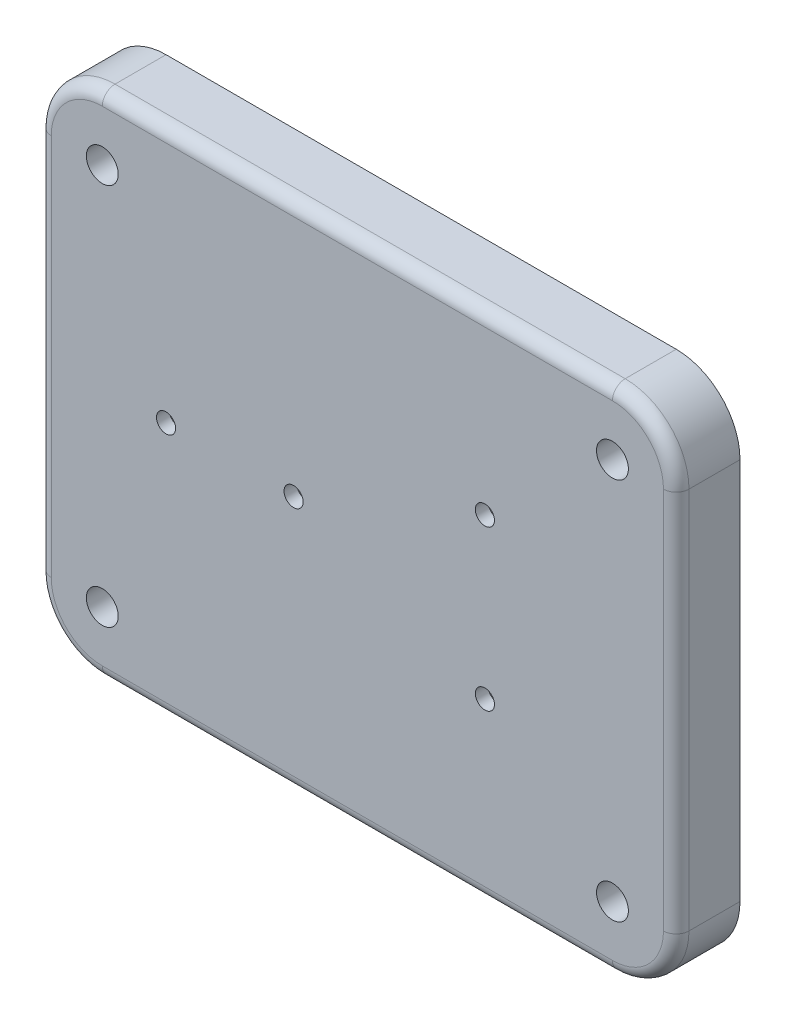
ISO-10303-21;
HEADER;
FILE_DESCRIPTION(('STEP AP214'),'2;1');
FILE_NAME('part.step','',(''),(''),'','','');
FILE_SCHEMA(('AUTOMOTIVE_DESIGN { 1 0 10303 214 1 1 1 1 }'));
ENDSEC;
DATA;
#1=APPLICATION_CONTEXT('core data for automotive mechanical design processes');
#2=APPLICATION_PROTOCOL_DEFINITION('international standard','automotive_design',2000,#1);
#3=PRODUCT_CONTEXT('',#1,'mechanical');
#4=PRODUCT('Part','Part','',(#3));
#5=PRODUCT_RELATED_PRODUCT_CATEGORY('part','',(#4));
#6=PRODUCT_DEFINITION_FORMATION('','',#4);
#7=PRODUCT_DEFINITION_CONTEXT('part definition',#1,'design');
#8=PRODUCT_DEFINITION('design','',#6,#7);
#9=PRODUCT_DEFINITION_SHAPE('','',#8);
#10=(LENGTH_UNIT() NAMED_UNIT(*) SI_UNIT(.MILLI.,.METRE.));
#11=(NAMED_UNIT(*) PLANE_ANGLE_UNIT() SI_UNIT($,.RADIAN.));
#12=(NAMED_UNIT(*) SI_UNIT($,.STERADIAN.) SOLID_ANGLE_UNIT());
#13=UNCERTAINTY_MEASURE_WITH_UNIT(LENGTH_MEASURE(1.E-05),#10,'distance_accuracy_value','');
#14=(GEOMETRIC_REPRESENTATION_CONTEXT(3) GLOBAL_UNCERTAINTY_ASSIGNED_CONTEXT((#13)) GLOBAL_UNIT_ASSIGNED_CONTEXT((#10,
#11,#12)) REPRESENTATION_CONTEXT('',''));
#15=CARTESIAN_POINT('',(0.,0.,0.));
#16=DIRECTION('',(0.,0.,1.));
#17=DIRECTION('',(1.,0.,0.));
#18=AXIS2_PLACEMENT_3D('',#15,#16,#17);
#19=CARTESIAN_POINT('',(0.,0.,0.));
#20=DIRECTION('',(0.,0.,-1.));
#21=DIRECTION('',(-1.,0.,0.));
#22=AXIS2_PLACEMENT_3D('',#19,#20,#21);
#23=PLANE('',#22);
#24=CARTESIAN_POINT('',(-40.,-30.,0.));
#25=DIRECTION('',(0.,0.,-1.));
#26=DIRECTION('',(1.,0.,0.));
#27=AXIS2_PLACEMENT_3D('',#24,#25,#26);
#28=CIRCLE('',#27,2.5);
#29=CARTESIAN_POINT('',(-37.5,-30.,0.));
#30=VERTEX_POINT('',#29);
#31=EDGE_CURVE('E310',#30,#30,#28,.T.);
#32=ORIENTED_EDGE('',*,*,#31,.F.);
#33=EDGE_LOOP('',(#32));
#34=FACE_BOUND('',#33,.T.);
#35=CARTESIAN_POINT('',(-40.,-30.,0.));
#36=DIRECTION('',(0.,0.,-1.));
#37=DIRECTION('',(-1.,0.,0.));
#38=AXIS2_PLACEMENT_3D('',#35,#36,#37);
#39=CIRCLE('',#38,4.5);
#40=CARTESIAN_POINT('',(-44.5,-30.,0.));
#41=VERTEX_POINT('',#40);
#42=EDGE_CURVE('E246',#41,#41,#39,.T.);
#43=ORIENTED_EDGE('',*,*,#42,.T.);
#44=EDGE_LOOP('',(#43));
#45=FACE_BOUND('',#44,.T.);
#46=ADVANCED_FACE('F39',(#34,#45),#23,.T.);
#47=CARTESIAN_POINT('',(40.,30.,0.));
#48=DIRECTION('',(0.,0.,-1.));
#49=DIRECTION('',(-1.,0.,0.));
#50=AXIS2_PLACEMENT_3D('',#47,#48,#49);
#51=CIRCLE('',#50,2.5);
#52=CARTESIAN_POINT('',(37.5,30.,0.));
#53=VERTEX_POINT('',#52);
#54=EDGE_CURVE('E328',#53,#53,#51,.T.);
#55=ORIENTED_EDGE('',*,*,#54,.F.);
#56=EDGE_LOOP('',(#55));
#57=FACE_BOUND('',#56,.T.);
#58=CARTESIAN_POINT('',(40.,30.,0.));
#59=DIRECTION('',(0.,0.,-1.));
#60=DIRECTION('',(-1.,0.,0.));
#61=AXIS2_PLACEMENT_3D('',#58,#59,#60);
#62=CIRCLE('',#61,4.5);
#63=CARTESIAN_POINT('',(35.5,30.,0.));
#64=VERTEX_POINT('',#63);
#65=EDGE_CURVE('E256',#64,#64,#62,.T.);
#66=ORIENTED_EDGE('',*,*,#65,.T.);
#67=EDGE_LOOP('',(#66));
#68=FACE_BOUND('',#67,.T.);
#69=ADVANCED_FACE('F564',(#57,#68),#23,.T.);
#70=CARTESIAN_POINT('',(40.,-30.,0.));
#71=DIRECTION('',(0.,0.,-1.));
#72=DIRECTION('',(-1.,0.,0.));
#73=AXIS2_PLACEMENT_3D('',#70,#71,#72);
#74=CIRCLE('',#73,4.5);
#75=CARTESIAN_POINT('',(35.5,-30.,0.));
#76=VERTEX_POINT('',#75);
#77=EDGE_CURVE('E251',#76,#76,#74,.F.);
#78=ORIENTED_EDGE('',*,*,#77,.F.);
#79=EDGE_LOOP('',(#78));
#80=FACE_BOUND('',#79,.T.);
#81=CARTESIAN_POINT('',(40.,-30.,0.));
#82=DIRECTION('',(0.,0.,1.));
#83=DIRECTION('',(-1.,0.,0.));
#84=AXIS2_PLACEMENT_3D('',#81,#82,#83);
#85=CIRCLE('',#84,2.5);
#86=CARTESIAN_POINT('',(37.5,-30.,0.));
#87=VERTEX_POINT('',#86);
#88=EDGE_CURVE('E320',#87,#87,#85,.T.);
#89=ORIENTED_EDGE('',*,*,#88,.T.);
#90=EDGE_LOOP('',(#89));
#91=FACE_BOUND('',#90,.T.);
#92=ADVANCED_FACE('F570',(#80,#91),#23,.T.);
#93=DIRECTION('',(0.,-1.,0.));
#94=VECTOR('',#93,1.);
#95=CARTESIAN_POINT('',(-50.,40.,0.));
#96=LINE('',#95,#94);
#97=CARTESIAN_POINT('',(-50.,30.,0.));
#98=VERTEX_POINT('',#97);
#99=CARTESIAN_POINT('',(-50.,-30.,0.));
#100=VERTEX_POINT('',#99);
#101=EDGE_CURVE('E340',#98,#100,#96,.T.);
#102=ORIENTED_EDGE('',*,*,#101,.F.);
#103=CARTESIAN_POINT('',(-40.,30.,0.));
#104=DIRECTION('',(0.,0.,-1.));
#105=DIRECTION('',(-1.,0.,0.));
#106=AXIS2_PLACEMENT_3D('',#103,#104,#105);
#107=CIRCLE('',#106,10.);
#108=CARTESIAN_POINT('',(-40.,40.,0.));
#109=VERTEX_POINT('',#108);
#110=EDGE_CURVE('E375',#98,#109,#107,.T.);
#111=ORIENTED_EDGE('',*,*,#110,.T.);
#112=DIRECTION('',(-1.,0.,0.));
#113=VECTOR('',#112,1.);
#114=CARTESIAN_POINT('',(50.,40.,0.));
#115=LINE('',#114,#113);
#116=CARTESIAN_POINT('',(40.,40.,0.));
#117=VERTEX_POINT('',#116);
#118=EDGE_CURVE('E355',#117,#109,#115,.T.);
#119=ORIENTED_EDGE('',*,*,#118,.F.);
#120=CARTESIAN_POINT('',(40.,30.,0.));
#121=DIRECTION('',(0.,0.,-1.));
#122=DIRECTION('',(-1.,0.,0.));
#123=AXIS2_PLACEMENT_3D('',#120,#121,#122);
#124=CIRCLE('',#123,10.);
#125=CARTESIAN_POINT('',(50.,30.,0.));
#126=VERTEX_POINT('',#125);
#127=EDGE_CURVE('E366',#117,#126,#124,.T.);
#128=ORIENTED_EDGE('',*,*,#127,.T.);
#129=DIRECTION('',(0.,1.,0.));
#130=VECTOR('',#129,1.);
#131=CARTESIAN_POINT('',(50.,40.,0.));
#132=LINE('',#131,#130);
#133=CARTESIAN_POINT('',(50.,-30.,0.));
#134=VERTEX_POINT('',#133);
#135=EDGE_CURVE('E351',#134,#126,#132,.T.);
#136=ORIENTED_EDGE('',*,*,#135,.F.);
#137=CARTESIAN_POINT('',(40.,-30.,0.));
#138=DIRECTION('',(0.,0.,-1.));
#139=DIRECTION('',(-1.,0.,0.));
#140=AXIS2_PLACEMENT_3D('',#137,#138,#139);
#141=CIRCLE('',#140,10.);
#142=CARTESIAN_POINT('',(40.,-40.,0.));
#143=VERTEX_POINT('',#142);
#144=EDGE_CURVE('E369',#134,#143,#141,.T.);
#145=ORIENTED_EDGE('',*,*,#144,.T.);
#146=DIRECTION('',(1.,0.,0.));
#147=VECTOR('',#146,1.);
#148=CARTESIAN_POINT('',(50.,-40.,0.));
#149=LINE('',#148,#147);
#150=CARTESIAN_POINT('',(-40.,-40.,0.));
#151=VERTEX_POINT('',#150);
#152=EDGE_CURVE('E347',#151,#143,#149,.T.);
#153=ORIENTED_EDGE('',*,*,#152,.F.);
#154=CARTESIAN_POINT('',(-40.,-30.,0.));
#155=DIRECTION('',(0.,0.,-1.));
#156=DIRECTION('',(-1.,0.,0.));
#157=AXIS2_PLACEMENT_3D('',#154,#155,#156);
#158=CIRCLE('',#157,10.);
#159=EDGE_CURVE('E372',#151,#100,#158,.T.);
#160=ORIENTED_EDGE('',*,*,#159,.T.);
#161=EDGE_LOOP('',(#102,#111,#119,#128,#136,#145,#153,#160));
#162=FACE_BOUND('',#161,.T.);
#163=CARTESIAN_POINT('',(-40.,30.,0.));
#164=DIRECTION('',(0.,0.,-1.));
#165=DIRECTION('',(-1.,0.,0.));
#166=AXIS2_PLACEMENT_3D('',#163,#164,#165);
#167=CIRCLE('',#166,8.);
#168=CARTESIAN_POINT('',(-48.,30.,0.));
#169=VERTEX_POINT('',#168);
#170=CARTESIAN_POINT('',(-40.,38.,0.));
#171=VERTEX_POINT('',#170);
#172=EDGE_CURVE('E277',#169,#171,#167,.T.);
#173=ORIENTED_EDGE('',*,*,#172,.F.);
#174=DIRECTION('',(0.,-1.,0.));
#175=VECTOR('',#174,1.);
#176=CARTESIAN_POINT('',(-48.,0.,0.));
#177=LINE('',#176,#175);
#178=CARTESIAN_POINT('',(-48.,-30.,0.));
#179=VERTEX_POINT('',#178);
#180=EDGE_CURVE('E281',#169,#179,#177,.T.);
#181=ORIENTED_EDGE('',*,*,#180,.T.);
#182=CARTESIAN_POINT('',(-40.,-30.,0.));
#183=DIRECTION('',(0.,0.,-1.));
#184=DIRECTION('',(-1.,0.,0.));
#185=AXIS2_PLACEMENT_3D('',#182,#183,#184);
#186=CIRCLE('',#185,8.);
#187=CARTESIAN_POINT('',(-40.,-38.,0.));
#188=VERTEX_POINT('',#187);
#189=EDGE_CURVE('E210',#188,#179,#186,.T.);
#190=ORIENTED_EDGE('',*,*,#189,.F.);
#191=DIRECTION('',(1.,0.,0.));
#192=VECTOR('',#191,1.);
#193=CARTESIAN_POINT('',(0.,-38.,0.));
#194=LINE('',#193,#192);
#195=CARTESIAN_POINT('',(40.,-38.,0.));
#196=VERTEX_POINT('',#195);
#197=EDGE_CURVE('E57',#188,#196,#194,.T.);
#198=ORIENTED_EDGE('',*,*,#197,.T.);
#199=CARTESIAN_POINT('',(40.,-30.,0.));
#200=DIRECTION('',(0.,0.,-1.));
#201=DIRECTION('',(-1.,0.,0.));
#202=AXIS2_PLACEMENT_3D('',#199,#200,#201);
#203=CIRCLE('',#202,8.);
#204=CARTESIAN_POINT('',(48.,-30.,0.));
#205=VERTEX_POINT('',#204);
#206=EDGE_CURVE('E288',#205,#196,#203,.T.);
#207=ORIENTED_EDGE('',*,*,#206,.F.);
#208=DIRECTION('',(0.,1.,0.));
#209=VECTOR('',#208,1.);
#210=CARTESIAN_POINT('',(48.,0.,0.));
#211=LINE('',#210,#209);
#212=CARTESIAN_POINT('',(48.,30.,0.));
#213=VERTEX_POINT('',#212);
#214=EDGE_CURVE('E219',#205,#213,#211,.T.);
#215=ORIENTED_EDGE('',*,*,#214,.T.);
#216=CARTESIAN_POINT('',(40.,30.,0.));
#217=DIRECTION('',(0.,0.,-1.));
#218=DIRECTION('',(-1.,0.,0.));
#219=AXIS2_PLACEMENT_3D('',#216,#217,#218);
#220=CIRCLE('',#219,8.);
#221=CARTESIAN_POINT('',(40.,38.,0.));
#222=VERTEX_POINT('',#221);
#223=EDGE_CURVE('E216',#222,#213,#220,.T.);
#224=ORIENTED_EDGE('',*,*,#223,.F.);
#225=DIRECTION('',(-1.,0.,0.));
#226=VECTOR('',#225,1.);
#227=CARTESIAN_POINT('',(0.,38.,0.));
#228=LINE('',#227,#226);
#229=EDGE_CURVE('E212',#222,#171,#228,.T.);
#230=ORIENTED_EDGE('',*,*,#229,.T.);
#231=EDGE_LOOP('',(#173,#181,#190,#198,#207,#215,#224,#230));
#232=FACE_BOUND('',#231,.T.);
#233=ADVANCED_FACE('F578',(#162,#232),#23,.T.);
#234=CARTESIAN_POINT('',(-50.,40.,10.));
#235=DIRECTION('',(1.,0.,0.));
#236=DIRECTION('',(0.,1.,0.));
#237=AXIS2_PLACEMENT_3D('',#234,#235,#236);
#238=PLANE('',#237);
#239=DIRECTION('',(0.,0.,-1.));
#240=VECTOR('',#239,1.);
#241=CARTESIAN_POINT('',(-50.,-30.,10.));
#242=LINE('',#241,#240);
#243=CARTESIAN_POINT('',(-50.,-30.,8.));
#244=VERTEX_POINT('',#243);
#245=EDGE_CURVE('E359',#100,#244,#242,.F.);
#246=ORIENTED_EDGE('',*,*,#245,.T.);
#247=DIRECTION('',(0.,-1.,0.));
#248=VECTOR('',#247,1.);
#249=CARTESIAN_POINT('',(-50.,40.,8.));
#250=LINE('',#249,#248);
#251=CARTESIAN_POINT('',(-50.,30.,8.));
#252=VERTEX_POINT('',#251);
#253=EDGE_CURVE('E439',#244,#252,#250,.F.);
#254=ORIENTED_EDGE('',*,*,#253,.T.);
#255=DIRECTION('',(0.,0.,-1.));
#256=VECTOR('',#255,1.);
#257=CARTESIAN_POINT('',(-50.,30.,10.));
#258=LINE('',#257,#256);
#259=EDGE_CURVE('E363',#252,#98,#258,.T.);
#260=ORIENTED_EDGE('',*,*,#259,.T.);
#261=ORIENTED_EDGE('',*,*,#101,.T.);
#262=EDGE_LOOP('',(#246,#254,#260,#261));
#263=FACE_BOUND('',#262,.T.);
#264=ADVANCED_FACE('F587',(#263),#238,.F.);
#265=CARTESIAN_POINT('',(50.,-40.,10.));
#266=DIRECTION('',(0.,1.,0.));
#267=DIRECTION('',(-1.,0.,0.));
#268=AXIS2_PLACEMENT_3D('',#265,#266,#267);
#269=PLANE('',#268);
#270=DIRECTION('',(0.,0.,-1.));
#271=VECTOR('',#270,1.);
#272=CARTESIAN_POINT('',(40.,-40.,10.));
#273=LINE('',#272,#271);
#274=CARTESIAN_POINT('',(40.,-40.,8.));
#275=VERTEX_POINT('',#274);
#276=EDGE_CURVE('E384',#143,#275,#273,.F.);
#277=ORIENTED_EDGE('',*,*,#276,.T.);
#278=DIRECTION('',(1.,0.,0.));
#279=VECTOR('',#278,1.);
#280=CARTESIAN_POINT('',(50.,-40.,8.));
#281=LINE('',#280,#279);
#282=CARTESIAN_POINT('',(-40.,-40.,8.));
#283=VERTEX_POINT('',#282);
#284=EDGE_CURVE('E433',#275,#283,#281,.F.);
#285=ORIENTED_EDGE('',*,*,#284,.T.);
#286=DIRECTION('',(0.,0.,-1.));
#287=VECTOR('',#286,1.);
#288=CARTESIAN_POINT('',(-40.,-40.,10.));
#289=LINE('',#288,#287);
#290=EDGE_CURVE('E388',#283,#151,#289,.T.);
#291=ORIENTED_EDGE('',*,*,#290,.T.);
#292=ORIENTED_EDGE('',*,*,#152,.T.);
#293=EDGE_LOOP('',(#277,#285,#291,#292));
#294=FACE_BOUND('',#293,.T.);
#295=ADVANCED_FACE('F593',(#294),#269,.F.);
#296=CARTESIAN_POINT('',(50.,40.,10.));
#297=DIRECTION('',(-1.,0.,0.));
#298=DIRECTION('',(0.,-1.,0.));
#299=AXIS2_PLACEMENT_3D('',#296,#297,#298);
#300=PLANE('',#299);
#301=DIRECTION('',(0.,0.,-1.));
#302=VECTOR('',#301,1.);
#303=CARTESIAN_POINT('',(50.,30.,10.));
#304=LINE('',#303,#302);
#305=CARTESIAN_POINT('',(50.,30.,8.));
#306=VERTEX_POINT('',#305);
#307=EDGE_CURVE('E391',#126,#306,#304,.F.);
#308=ORIENTED_EDGE('',*,*,#307,.T.);
#309=DIRECTION('',(0.,1.,0.));
#310=VECTOR('',#309,1.);
#311=CARTESIAN_POINT('',(50.,40.,8.));
#312=LINE('',#311,#310);
#313=CARTESIAN_POINT('',(50.,-30.,8.));
#314=VERTEX_POINT('',#313);
#315=EDGE_CURVE('E427',#306,#314,#312,.F.);
#316=ORIENTED_EDGE('',*,*,#315,.T.);
#317=DIRECTION('',(0.,0.,-1.));
#318=VECTOR('',#317,1.);
#319=CARTESIAN_POINT('',(50.,-30.,10.));
#320=LINE('',#319,#318);
#321=EDGE_CURVE('E395',#314,#134,#320,.T.);
#322=ORIENTED_EDGE('',*,*,#321,.T.);
#323=ORIENTED_EDGE('',*,*,#135,.T.);
#324=EDGE_LOOP('',(#308,#316,#322,#323));
#325=FACE_BOUND('',#324,.T.);
#326=ADVANCED_FACE('F811',(#325),#300,.F.);
#327=CARTESIAN_POINT('',(50.,40.,10.));
#328=DIRECTION('',(0.,-1.,0.));
#329=DIRECTION('',(1.,0.,0.));
#330=AXIS2_PLACEMENT_3D('',#327,#328,#329);
#331=PLANE('',#330);
#332=DIRECTION('',(0.,0.,-1.));
#333=VECTOR('',#332,1.);
#334=CARTESIAN_POINT('',(-40.,40.,10.));
#335=LINE('',#334,#333);
#336=CARTESIAN_POINT('',(-40.,40.,8.));
#337=VERTEX_POINT('',#336);
#338=EDGE_CURVE('E381',#109,#337,#335,.F.);
#339=ORIENTED_EDGE('',*,*,#338,.T.);
#340=DIRECTION('',(-1.,0.,0.));
#341=VECTOR('',#340,1.);
#342=CARTESIAN_POINT('',(50.,40.,8.));
#343=LINE('',#342,#341);
#344=CARTESIAN_POINT('',(40.,40.,8.));
#345=VERTEX_POINT('',#344);
#346=EDGE_CURVE('E11',#337,#345,#343,.F.);
#347=ORIENTED_EDGE('',*,*,#346,.T.);
#348=DIRECTION('',(0.,0.,-1.));
#349=VECTOR('',#348,1.);
#350=CARTESIAN_POINT('',(40.,40.,10.));
#351=LINE('',#350,#349);
#352=EDGE_CURVE('E378',#345,#117,#351,.T.);
#353=ORIENTED_EDGE('',*,*,#352,.T.);
#354=ORIENTED_EDGE('',*,*,#118,.T.);
#355=EDGE_LOOP('',(#339,#347,#353,#354));
#356=FACE_BOUND('',#355,.T.);
#357=ADVANCED_FACE('F530',(#356),#331,.F.);
#358=CARTESIAN_POINT('',(0.,0.,10.));
#359=DIRECTION('',(0.,0.,-1.));
#360=DIRECTION('',(-1.,0.,0.));
#361=AXIS2_PLACEMENT_3D('',#358,#359,#360);
#362=PLANE('',#361);
#363=CARTESIAN_POINT('',(20.,12.5,10.));
#364=DIRECTION('',(0.,0.,1.));
#365=DIRECTION('',(1.,0.,0.));
#366=AXIS2_PLACEMENT_3D('',#363,#364,#365);
#367=CIRCLE('',#366,1.5);
#368=CARTESIAN_POINT('',(21.5,12.5,10.));
#369=VERTEX_POINT('',#368);
#370=EDGE_CURVE('E520',#369,#369,#367,.T.);
#371=ORIENTED_EDGE('',*,*,#370,.F.);
#372=EDGE_LOOP('',(#371));
#373=FACE_BOUND('',#372,.T.);
#374=CARTESIAN_POINT('',(20.,-12.5,10.));
#375=DIRECTION('',(0.,0.,1.));
#376=DIRECTION('',(1.,0.,0.));
#377=AXIS2_PLACEMENT_3D('',#374,#375,#376);
#378=CIRCLE('',#377,1.5);
#379=CARTESIAN_POINT('',(21.5,-12.5,10.));
#380=VERTEX_POINT('',#379);
#381=EDGE_CURVE('E514',#380,#380,#378,.T.);
#382=ORIENTED_EDGE('',*,*,#381,.F.);
#383=EDGE_LOOP('',(#382));
#384=FACE_BOUND('',#383,.T.);
#385=CARTESIAN_POINT('',(-30.,0.,10.));
#386=DIRECTION('',(0.,0.,1.));
#387=DIRECTION('',(1.,0.,0.));
#388=AXIS2_PLACEMENT_3D('',#385,#386,#387);
#389=CIRCLE('',#388,1.5);
#390=CARTESIAN_POINT('',(-28.5,0.,10.));
#391=VERTEX_POINT('',#390);
#392=EDGE_CURVE('E511',#391,#391,#389,.T.);
#393=ORIENTED_EDGE('',*,*,#392,.F.);
#394=EDGE_LOOP('',(#393));
#395=FACE_BOUND('',#394,.T.);
#396=CARTESIAN_POINT('',(-10.,0.,10.));
#397=DIRECTION('',(0.,0.,1.));
#398=DIRECTION('',(1.,0.,0.));
#399=AXIS2_PLACEMENT_3D('',#396,#397,#398);
#400=CIRCLE('',#399,1.5);
#401=CARTESIAN_POINT('',(-8.5,0.,10.));
#402=VERTEX_POINT('',#401);
#403=EDGE_CURVE('E222',#402,#402,#400,.T.);
#404=ORIENTED_EDGE('',*,*,#403,.F.);
#405=EDGE_LOOP('',(#404));
#406=FACE_BOUND('',#405,.T.);
#407=DIRECTION('',(0.,1.,0.));
#408=VECTOR('',#407,1.);
#409=CARTESIAN_POINT('',(48.,0.,10.));
#410=LINE('',#409,#408);
#411=CARTESIAN_POINT('',(48.,-30.,10.));
#412=VERTEX_POINT('',#411);
#413=CARTESIAN_POINT('',(48.,30.,10.));
#414=VERTEX_POINT('',#413);
#415=EDGE_CURVE('E416',#412,#414,#410,.T.);
#416=ORIENTED_EDGE('',*,*,#415,.T.);
#417=CARTESIAN_POINT('',(40.,30.,10.));
#418=DIRECTION('',(0.,0.,-1.));
#419=DIRECTION('',(-1.,0.,0.));
#420=AXIS2_PLACEMENT_3D('',#417,#418,#419);
#421=CIRCLE('',#420,8.);
#422=CARTESIAN_POINT('',(40.,38.,10.));
#423=VERTEX_POINT('',#422);
#424=EDGE_CURVE('E419',#414,#423,#421,.F.);
#425=ORIENTED_EDGE('',*,*,#424,.T.);
#426=DIRECTION('',(-1.,0.,0.));
#427=VECTOR('',#426,1.);
#428=CARTESIAN_POINT('',(0.,38.,10.));
#429=LINE('',#428,#427);
#430=CARTESIAN_POINT('',(-40.,38.,10.));
#431=VERTEX_POINT('',#430);
#432=EDGE_CURVE('E398',#423,#431,#429,.T.);
#433=ORIENTED_EDGE('',*,*,#432,.T.);
#434=CARTESIAN_POINT('',(-40.,30.,10.));
#435=DIRECTION('',(0.,0.,-1.));
#436=DIRECTION('',(-1.,0.,0.));
#437=AXIS2_PLACEMENT_3D('',#434,#435,#436);
#438=CIRCLE('',#437,8.);
#439=CARTESIAN_POINT('',(-48.,30.,10.));
#440=VERTEX_POINT('',#439);
#441=EDGE_CURVE('E401',#431,#440,#438,.F.);
#442=ORIENTED_EDGE('',*,*,#441,.T.);
#443=DIRECTION('',(0.,-1.,0.));
#444=VECTOR('',#443,1.);
#445=CARTESIAN_POINT('',(-48.,0.,10.));
#446=LINE('',#445,#444);
#447=CARTESIAN_POINT('',(-48.,-30.,10.));
#448=VERTEX_POINT('',#447);
#449=EDGE_CURVE('E404',#440,#448,#446,.T.);
#450=ORIENTED_EDGE('',*,*,#449,.T.);
#451=CARTESIAN_POINT('',(-40.,-30.,10.));
#452=DIRECTION('',(0.,0.,-1.));
#453=DIRECTION('',(-1.,0.,0.));
#454=AXIS2_PLACEMENT_3D('',#451,#452,#453);
#455=CIRCLE('',#454,8.);
#456=CARTESIAN_POINT('',(-40.,-38.,10.));
#457=VERTEX_POINT('',#456);
#458=EDGE_CURVE('E407',#448,#457,#455,.F.);
#459=ORIENTED_EDGE('',*,*,#458,.T.);
#460=DIRECTION('',(1.,0.,0.));
#461=VECTOR('',#460,1.);
#462=CARTESIAN_POINT('',(0.,-38.,10.));
#463=LINE('',#462,#461);
#464=CARTESIAN_POINT('',(40.,-38.,10.));
#465=VERTEX_POINT('',#464);
#466=EDGE_CURVE('E410',#457,#465,#463,.T.);
#467=ORIENTED_EDGE('',*,*,#466,.T.);
#468=CARTESIAN_POINT('',(40.,-30.,10.));
#469=DIRECTION('',(0.,0.,-1.));
#470=DIRECTION('',(-1.,0.,0.));
#471=AXIS2_PLACEMENT_3D('',#468,#469,#470);
#472=CIRCLE('',#471,8.);
#473=EDGE_CURVE('E413',#465,#412,#472,.F.);
#474=ORIENTED_EDGE('',*,*,#473,.T.);
#475=EDGE_LOOP('',(#416,#425,#433,#442,#450,#459,#467,#474));
#476=FACE_BOUND('',#475,.T.);
#477=CARTESIAN_POINT('',(-40.,-30.,10.));
#478=DIRECTION('',(0.,0.,-1.));
#479=DIRECTION('',(1.,0.,0.));
#480=AXIS2_PLACEMENT_3D('',#477,#478,#479);
#481=CIRCLE('',#480,2.5);
#482=CARTESIAN_POINT('',(-37.5,-30.,10.));
#483=VERTEX_POINT('',#482);
#484=EDGE_CURVE('E315',#483,#483,#481,.T.);
#485=ORIENTED_EDGE('',*,*,#484,.T.);
#486=EDGE_LOOP('',(#485));
#487=FACE_BOUND('',#486,.T.);
#488=CARTESIAN_POINT('',(40.,-30.,10.));
#489=DIRECTION('',(0.,0.,1.));
#490=DIRECTION('',(-1.,0.,0.));
#491=AXIS2_PLACEMENT_3D('',#488,#489,#490);
#492=CIRCLE('',#491,2.5);
#493=CARTESIAN_POINT('',(37.5,-30.,10.));
#494=VERTEX_POINT('',#493);
#495=EDGE_CURVE('E314',#494,#494,#492,.T.);
#496=ORIENTED_EDGE('',*,*,#495,.F.);
#497=EDGE_LOOP('',(#496));
#498=FACE_BOUND('',#497,.T.);
#499=CARTESIAN_POINT('',(40.,30.,10.));
#500=DIRECTION('',(0.,0.,-1.));
#501=DIRECTION('',(-1.,0.,0.));
#502=AXIS2_PLACEMENT_3D('',#499,#500,#501);
#503=CIRCLE('',#502,2.5);
#504=CARTESIAN_POINT('',(37.5,30.,10.));
#505=VERTEX_POINT('',#504);
#506=EDGE_CURVE('E324',#505,#505,#503,.T.);
#507=ORIENTED_EDGE('',*,*,#506,.T.);
#508=EDGE_LOOP('',(#507));
#509=FACE_BOUND('',#508,.T.);
#510=CARTESIAN_POINT('',(-40.,30.,10.));
#511=DIRECTION('',(0.,0.,1.));
#512=DIRECTION('',(1.,0.,0.));
#513=AXIS2_PLACEMENT_3D('',#510,#511,#512);
#514=CIRCLE('',#513,2.5);
#515=CARTESIAN_POINT('',(-37.5,30.,10.));
#516=VERTEX_POINT('',#515);
#517=EDGE_CURVE('E332',#516,#516,#514,.T.);
#518=ORIENTED_EDGE('',*,*,#517,.F.);
#519=EDGE_LOOP('',(#518));
#520=FACE_BOUND('',#519,.T.);
#521=ADVANCED_FACE('F526',(#373,#384,#395,#406,#476,#487,#498,#509,#520),#362,.F.);
#522=CARTESIAN_POINT('',(-40.,30.,0.));
#523=DIRECTION('',(0.,0.,-1.));
#524=DIRECTION('',(-1.,0.,0.));
#525=AXIS2_PLACEMENT_3D('',#522,#523,#524);
#526=CIRCLE('',#525,4.5);
#527=CARTESIAN_POINT('',(-44.5,30.,0.));
#528=VERTEX_POINT('',#527);
#529=EDGE_CURVE('E261',#528,#528,#526,.F.);
#530=ORIENTED_EDGE('',*,*,#529,.F.);
#531=EDGE_LOOP('',(#530));
#532=FACE_BOUND('',#531,.T.);
#533=CARTESIAN_POINT('',(-40.,30.,0.));
#534=DIRECTION('',(0.,0.,1.));
#535=DIRECTION('',(1.,0.,0.));
#536=AXIS2_PLACEMENT_3D('',#533,#534,#535);
#537=CIRCLE('',#536,2.5);
#538=CARTESIAN_POINT('',(-37.5,30.,0.));
#539=VERTEX_POINT('',#538);
#540=EDGE_CURVE('E336',#539,#539,#537,.T.);
#541=ORIENTED_EDGE('',*,*,#540,.T.);
#542=EDGE_LOOP('',(#541));
#543=FACE_BOUND('',#542,.T.);
#544=ADVANCED_FACE('F529',(#532,#543),#23,.T.);
#545=CARTESIAN_POINT('',(-40.,30.,10.));
#546=DIRECTION('',(0.,0.,-1.));
#547=DIRECTION('',(-1.,0.,0.));
#548=AXIS2_PLACEMENT_3D('',#545,#546,#547);
#549=CYLINDRICAL_SURFACE('',#548,10.);
#550=ORIENTED_EDGE('',*,*,#259,.F.);
#551=CARTESIAN_POINT('',(-40.,30.,8.));
#552=DIRECTION('',(0.,0.,-1.));
#553=DIRECTION('',(-1.,0.,0.));
#554=AXIS2_PLACEMENT_3D('',#551,#552,#553);
#555=CIRCLE('',#554,10.);
#556=EDGE_CURVE('E49',#252,#337,#555,.T.);
#557=ORIENTED_EDGE('',*,*,#556,.T.);
#558=ORIENTED_EDGE('',*,*,#338,.F.);
#559=ORIENTED_EDGE('',*,*,#110,.F.);
#560=EDGE_LOOP('',(#550,#557,#558,#559));
#561=FACE_BOUND('',#560,.T.);
#562=ADVANCED_FACE('F576',(#561),#549,.T.);
#563=CARTESIAN_POINT('',(-40.,-30.,10.));
#564=DIRECTION('',(0.,0.,-1.));
#565=DIRECTION('',(-1.,0.,0.));
#566=AXIS2_PLACEMENT_3D('',#563,#564,#565);
#567=CYLINDRICAL_SURFACE('',#566,10.);
#568=ORIENTED_EDGE('',*,*,#290,.F.);
#569=CARTESIAN_POINT('',(-40.,-30.,8.));
#570=DIRECTION('',(0.,0.,-1.));
#571=DIRECTION('',(-1.,0.,0.));
#572=AXIS2_PLACEMENT_3D('',#569,#570,#571);
#573=CIRCLE('',#572,10.);
#574=EDGE_CURVE('E436',#283,#244,#573,.T.);
#575=ORIENTED_EDGE('',*,*,#574,.T.);
#576=ORIENTED_EDGE('',*,*,#245,.F.);
#577=ORIENTED_EDGE('',*,*,#159,.F.);
#578=EDGE_LOOP('',(#568,#575,#576,#577));
#579=FACE_BOUND('',#578,.T.);
#580=ADVANCED_FACE('F582',(#579),#567,.T.);
#581=CARTESIAN_POINT('',(40.,-30.,10.));
#582=DIRECTION('',(0.,0.,-1.));
#583=DIRECTION('',(-1.,0.,0.));
#584=AXIS2_PLACEMENT_3D('',#581,#582,#583);
#585=CYLINDRICAL_SURFACE('',#584,10.);
#586=ORIENTED_EDGE('',*,*,#321,.F.);
#587=CARTESIAN_POINT('',(40.,-30.,8.));
#588=DIRECTION('',(0.,0.,-1.));
#589=DIRECTION('',(-1.,0.,0.));
#590=AXIS2_PLACEMENT_3D('',#587,#588,#589);
#591=CIRCLE('',#590,10.);
#592=EDGE_CURVE('E430',#314,#275,#591,.T.);
#593=ORIENTED_EDGE('',*,*,#592,.T.);
#594=ORIENTED_EDGE('',*,*,#276,.F.);
#595=ORIENTED_EDGE('',*,*,#144,.F.);
#596=EDGE_LOOP('',(#586,#593,#594,#595));
#597=FACE_BOUND('',#596,.T.);
#598=ADVANCED_FACE('F559',(#597),#585,.T.);
#599=CARTESIAN_POINT('',(40.,30.,10.));
#600=DIRECTION('',(0.,0.,-1.));
#601=DIRECTION('',(-1.,0.,0.));
#602=AXIS2_PLACEMENT_3D('',#599,#600,#601);
#603=CYLINDRICAL_SURFACE('',#602,10.);
#604=ORIENTED_EDGE('',*,*,#352,.F.);
#605=CARTESIAN_POINT('',(40.,30.,8.));
#606=DIRECTION('',(0.,0.,-1.));
#607=DIRECTION('',(-1.,0.,0.));
#608=AXIS2_PLACEMENT_3D('',#605,#606,#607);
#609=CIRCLE('',#608,10.);
#610=EDGE_CURVE('E423',#345,#306,#609,.T.);
#611=ORIENTED_EDGE('',*,*,#610,.T.);
#612=ORIENTED_EDGE('',*,*,#307,.F.);
#613=ORIENTED_EDGE('',*,*,#127,.F.);
#614=EDGE_LOOP('',(#604,#611,#612,#613));
#615=FACE_BOUND('',#614,.T.);
#616=ADVANCED_FACE('F549',(#615),#603,.T.);
#617=CARTESIAN_POINT('',(-40.,30.,0.));
#618=DIRECTION('',(0.,0.,1.));
#619=DIRECTION('',(1.,0.,0.));
#620=AXIS2_PLACEMENT_3D('',#617,#618,#619);
#621=CYLINDRICAL_SURFACE('',#620,2.5);
#622=ORIENTED_EDGE('',*,*,#540,.F.);
#623=EDGE_LOOP('',(#622));
#624=FACE_BOUND('',#623,.T.);
#625=ORIENTED_EDGE('',*,*,#517,.T.);
#626=EDGE_LOOP('',(#625));
#627=FACE_BOUND('',#626,.T.);
#628=ADVANCED_FACE('F546',(#624,#627),#621,.F.);
#629=CARTESIAN_POINT('',(40.,30.,0.));
#630=DIRECTION('',(0.,0.,1.));
#631=DIRECTION('',(1.,0.,0.));
#632=AXIS2_PLACEMENT_3D('',#629,#630,#631);
#633=CYLINDRICAL_SURFACE('',#632,2.5);
#634=ORIENTED_EDGE('',*,*,#54,.T.);
#635=EDGE_LOOP('',(#634));
#636=FACE_BOUND('',#635,.T.);
#637=ORIENTED_EDGE('',*,*,#506,.F.);
#638=EDGE_LOOP('',(#637));
#639=FACE_BOUND('',#638,.T.);
#640=ADVANCED_FACE('F548',(#636,#639),#633,.F.);
#641=CARTESIAN_POINT('',(40.,-30.,0.));
#642=DIRECTION('',(0.,0.,1.));
#643=DIRECTION('',(1.,0.,0.));
#644=AXIS2_PLACEMENT_3D('',#641,#642,#643);
#645=CYLINDRICAL_SURFACE('',#644,2.5);
#646=ORIENTED_EDGE('',*,*,#88,.F.);
#647=EDGE_LOOP('',(#646));
#648=FACE_BOUND('',#647,.T.);
#649=ORIENTED_EDGE('',*,*,#495,.T.);
#650=EDGE_LOOP('',(#649));
#651=FACE_BOUND('',#650,.T.);
#652=ADVANCED_FACE('F556',(#648,#651),#645,.F.);
#653=CARTESIAN_POINT('',(-40.,-30.,0.));
#654=DIRECTION('',(0.,0.,1.));
#655=DIRECTION('',(1.,0.,0.));
#656=AXIS2_PLACEMENT_3D('',#653,#654,#655);
#657=CYLINDRICAL_SURFACE('',#656,2.5);
#658=ORIENTED_EDGE('',*,*,#31,.T.);
#659=EDGE_LOOP('',(#658));
#660=FACE_BOUND('',#659,.T.);
#661=ORIENTED_EDGE('',*,*,#484,.F.);
#662=EDGE_LOOP('',(#661));
#663=FACE_BOUND('',#662,.T.);
#664=ADVANCED_FACE('F642',(#660,#663),#657,.F.);
#665=CARTESIAN_POINT('',(-40.,-30.,8.));
#666=DIRECTION('',(0.,0.,-1.));
#667=DIRECTION('',(-1.,0.,0.));
#668=AXIS2_PLACEMENT_3D('',#665,#666,#667);
#669=TOROIDAL_SURFACE('',#668,8.,2.);
#670=CARTESIAN_POINT('',(-48.,-30.,8.));
#671=DIRECTION('',(0.,1.,0.));
#672=DIRECTION('',(0.,0.,1.));
#673=AXIS2_PLACEMENT_3D('',#670,#671,#672);
#674=CIRCLE('',#673,2.);
#675=EDGE_CURVE('E465',#244,#448,#674,.T.);
#676=ORIENTED_EDGE('',*,*,#675,.F.);
#677=ORIENTED_EDGE('',*,*,#574,.F.);
#678=CARTESIAN_POINT('',(-40.,-38.,8.));
#679=DIRECTION('',(1.,0.,0.));
#680=DIRECTION('',(0.,0.,-1.));
#681=AXIS2_PLACEMENT_3D('',#678,#679,#680);
#682=CIRCLE('',#681,2.);
#683=EDGE_CURVE('E319',#457,#283,#682,.T.);
#684=ORIENTED_EDGE('',*,*,#683,.F.);
#685=ORIENTED_EDGE('',*,*,#458,.F.);
#686=EDGE_LOOP('',(#676,#677,#684,#685));
#687=FACE_BOUND('',#686,.T.);
#688=ADVANCED_FACE('F41',(#687),#669,.T.);
#689=CARTESIAN_POINT('',(0.,-38.,8.));
#690=DIRECTION('',(1.,0.,0.));
#691=DIRECTION('',(0.,1.,0.));
#692=AXIS2_PLACEMENT_3D('',#689,#690,#691);
#693=CYLINDRICAL_SURFACE('',#692,2.);
#694=ORIENTED_EDGE('',*,*,#683,.T.);
#695=ORIENTED_EDGE('',*,*,#284,.F.);
#696=CARTESIAN_POINT('',(40.,-38.,8.));
#697=DIRECTION('',(1.,0.,0.));
#698=DIRECTION('',(0.,0.,-1.));
#699=AXIS2_PLACEMENT_3D('',#696,#697,#698);
#700=CIRCLE('',#699,2.);
#701=EDGE_CURVE('E461',#465,#275,#700,.T.);
#702=ORIENTED_EDGE('',*,*,#701,.F.);
#703=ORIENTED_EDGE('',*,*,#466,.F.);
#704=EDGE_LOOP('',(#694,#695,#702,#703));
#705=FACE_BOUND('',#704,.T.);
#706=ADVANCED_FACE('F666',(#705),#693,.T.);
#707=CARTESIAN_POINT('',(-48.,0.,8.));
#708=DIRECTION('',(0.,-1.,0.));
#709=DIRECTION('',(1.,0.,0.));
#710=AXIS2_PLACEMENT_3D('',#707,#708,#709);
#711=CYLINDRICAL_SURFACE('',#710,2.);
#712=ORIENTED_EDGE('',*,*,#675,.T.);
#713=ORIENTED_EDGE('',*,*,#449,.F.);
#714=CARTESIAN_POINT('',(-48.,30.,8.));
#715=DIRECTION('',(0.,1.,0.));
#716=DIRECTION('',(0.,0.,1.));
#717=AXIS2_PLACEMENT_3D('',#714,#715,#716);
#718=CIRCLE('',#717,2.);
#719=EDGE_CURVE('E457',#252,#440,#718,.T.);
#720=ORIENTED_EDGE('',*,*,#719,.F.);
#721=ORIENTED_EDGE('',*,*,#253,.F.);
#722=EDGE_LOOP('',(#712,#713,#720,#721));
#723=FACE_BOUND('',#722,.T.);
#724=ADVANCED_FACE('F674',(#723),#711,.T.);
#725=CARTESIAN_POINT('',(40.,-30.,8.));
#726=DIRECTION('',(0.,0.,-1.));
#727=DIRECTION('',(-1.,0.,0.));
#728=AXIS2_PLACEMENT_3D('',#725,#726,#727);
#729=TOROIDAL_SURFACE('',#728,8.,2.);
#730=ORIENTED_EDGE('',*,*,#701,.T.);
#731=ORIENTED_EDGE('',*,*,#592,.F.);
#732=CARTESIAN_POINT('',(48.,-30.,8.));
#733=DIRECTION('',(0.,1.,0.));
#734=DIRECTION('',(0.,0.,1.));
#735=AXIS2_PLACEMENT_3D('',#732,#733,#734);
#736=CIRCLE('',#735,2.);
#737=EDGE_CURVE('E453',#412,#314,#736,.T.);
#738=ORIENTED_EDGE('',*,*,#737,.F.);
#739=ORIENTED_EDGE('',*,*,#473,.F.);
#740=EDGE_LOOP('',(#730,#731,#738,#739));
#741=FACE_BOUND('',#740,.T.);
#742=ADVANCED_FACE('F681',(#741),#729,.T.);
#743=CARTESIAN_POINT('',(-40.,30.,8.));
#744=DIRECTION('',(0.,0.,-1.));
#745=DIRECTION('',(-1.,0.,0.));
#746=AXIS2_PLACEMENT_3D('',#743,#744,#745);
#747=TOROIDAL_SURFACE('',#746,8.,2.);
#748=ORIENTED_EDGE('',*,*,#719,.T.);
#749=ORIENTED_EDGE('',*,*,#441,.F.);
#750=CARTESIAN_POINT('',(-40.,38.,8.));
#751=DIRECTION('',(1.,0.,0.));
#752=DIRECTION('',(0.,0.,-1.));
#753=AXIS2_PLACEMENT_3D('',#750,#751,#752);
#754=CIRCLE('',#753,2.);
#755=EDGE_CURVE('E449',#337,#431,#754,.T.);
#756=ORIENTED_EDGE('',*,*,#755,.F.);
#757=ORIENTED_EDGE('',*,*,#556,.F.);
#758=EDGE_LOOP('',(#748,#749,#756,#757));
#759=FACE_BOUND('',#758,.T.);
#760=ADVANCED_FACE('F689',(#759),#747,.T.);
#761=CARTESIAN_POINT('',(48.,0.,8.));
#762=DIRECTION('',(0.,1.,0.));
#763=DIRECTION('',(-1.,0.,0.));
#764=AXIS2_PLACEMENT_3D('',#761,#762,#763);
#765=CYLINDRICAL_SURFACE('',#764,2.);
#766=ORIENTED_EDGE('',*,*,#737,.T.);
#767=ORIENTED_EDGE('',*,*,#315,.F.);
#768=CARTESIAN_POINT('',(48.,30.,8.));
#769=DIRECTION('',(0.,1.,0.));
#770=DIRECTION('',(0.,0.,1.));
#771=AXIS2_PLACEMENT_3D('',#768,#769,#770);
#772=CIRCLE('',#771,2.);
#773=EDGE_CURVE('E446',#414,#306,#772,.T.);
#774=ORIENTED_EDGE('',*,*,#773,.F.);
#775=ORIENTED_EDGE('',*,*,#415,.F.);
#776=EDGE_LOOP('',(#766,#767,#774,#775));
#777=FACE_BOUND('',#776,.T.);
#778=ADVANCED_FACE('F697',(#777),#765,.T.);
#779=CARTESIAN_POINT('',(0.,38.,8.));
#780=DIRECTION('',(-1.,0.,0.));
#781=DIRECTION('',(0.,-1.,0.));
#782=AXIS2_PLACEMENT_3D('',#779,#780,#781);
#783=CYLINDRICAL_SURFACE('',#782,2.);
#784=ORIENTED_EDGE('',*,*,#755,.T.);
#785=ORIENTED_EDGE('',*,*,#432,.F.);
#786=CARTESIAN_POINT('',(40.,38.,8.));
#787=DIRECTION('',(1.,0.,0.));
#788=DIRECTION('',(0.,0.,-1.));
#789=AXIS2_PLACEMENT_3D('',#786,#787,#788);
#790=CIRCLE('',#789,2.);
#791=EDGE_CURVE('E206',#345,#423,#790,.T.);
#792=ORIENTED_EDGE('',*,*,#791,.F.);
#793=ORIENTED_EDGE('',*,*,#346,.F.);
#794=EDGE_LOOP('',(#784,#785,#792,#793));
#795=FACE_BOUND('',#794,.T.);
#796=ADVANCED_FACE('F705',(#795),#783,.T.);
#797=CARTESIAN_POINT('',(40.,30.,8.));
#798=DIRECTION('',(0.,0.,-1.));
#799=DIRECTION('',(-1.,0.,0.));
#800=AXIS2_PLACEMENT_3D('',#797,#798,#799);
#801=TOROIDAL_SURFACE('',#800,8.,2.);
#802=ORIENTED_EDGE('',*,*,#773,.T.);
#803=ORIENTED_EDGE('',*,*,#610,.F.);
#804=ORIENTED_EDGE('',*,*,#791,.T.);
#805=ORIENTED_EDGE('',*,*,#424,.F.);
#806=EDGE_LOOP('',(#802,#803,#804,#805));
#807=FACE_BOUND('',#806,.T.);
#808=ADVANCED_FACE('F713',(#807),#801,.T.);
#809=CARTESIAN_POINT('',(-48.,40.,10.));
#810=DIRECTION('',(1.,0.,0.));
#811=DIRECTION('',(0.,1.,0.));
#812=AXIS2_PLACEMENT_3D('',#809,#810,#811);
#813=PLANE('',#812);
#814=DIRECTION('',(0.,0.,1.));
#815=VECTOR('',#814,1.);
#816=CARTESIAN_POINT('',(-48.,-30.,10.));
#817=LINE('',#816,#815);
#818=CARTESIAN_POINT('',(-48.,-30.,8.));
#819=VERTEX_POINT('',#818);
#820=EDGE_CURVE('E186',#179,#819,#817,.T.);
#821=ORIENTED_EDGE('',*,*,#820,.F.);
#822=ORIENTED_EDGE('',*,*,#180,.F.);
#823=DIRECTION('',(0.,0.,1.));
#824=VECTOR('',#823,1.);
#825=CARTESIAN_POINT('',(-48.,30.,10.));
#826=LINE('',#825,#824);
#827=CARTESIAN_POINT('',(-48.,30.,8.));
#828=VERTEX_POINT('',#827);
#829=EDGE_CURVE('E188',#828,#169,#826,.F.);
#830=ORIENTED_EDGE('',*,*,#829,.F.);
#831=DIRECTION('',(0.,-1.,0.));
#832=VECTOR('',#831,1.);
#833=CARTESIAN_POINT('',(-48.,0.,8.));
#834=LINE('',#833,#832);
#835=EDGE_CURVE('E181',#828,#819,#834,.T.);
#836=ORIENTED_EDGE('',*,*,#835,.T.);
#837=EDGE_LOOP('',(#821,#822,#830,#836));
#838=FACE_BOUND('',#837,.T.);
#839=ADVANCED_FACE('F183',(#838),#813,.T.);
#840=CARTESIAN_POINT('',(50.,-38.,10.));
#841=DIRECTION('',(0.,1.,0.));
#842=DIRECTION('',(-1.,0.,0.));
#843=AXIS2_PLACEMENT_3D('',#840,#841,#842);
#844=PLANE('',#843);
#845=DIRECTION('',(0.,0.,1.));
#846=VECTOR('',#845,1.);
#847=CARTESIAN_POINT('',(40.,-38.,10.));
#848=LINE('',#847,#846);
#849=CARTESIAN_POINT('',(40.,-38.,8.));
#850=VERTEX_POINT('',#849);
#851=EDGE_CURVE('E262',#196,#850,#848,.T.);
#852=ORIENTED_EDGE('',*,*,#851,.F.);
#853=ORIENTED_EDGE('',*,*,#197,.F.);
#854=DIRECTION('',(0.,0.,1.));
#855=VECTOR('',#854,1.);
#856=CARTESIAN_POINT('',(-40.,-38.,10.));
#857=LINE('',#856,#855);
#858=CARTESIAN_POINT('',(-40.,-38.,8.));
#859=VERTEX_POINT('',#858);
#860=EDGE_CURVE('E265',#859,#188,#857,.F.);
#861=ORIENTED_EDGE('',*,*,#860,.F.);
#862=DIRECTION('',(-1.,0.,0.));
#863=VECTOR('',#862,1.);
#864=CARTESIAN_POINT('',(50.,-38.,8.));
#865=LINE('',#864,#863);
#866=EDGE_CURVE('E203',#850,#859,#865,.T.);
#867=ORIENTED_EDGE('',*,*,#866,.F.);
#868=EDGE_LOOP('',(#852,#853,#861,#867));
#869=FACE_BOUND('',#868,.T.);
#870=ADVANCED_FACE('F617',(#869),#844,.T.);
#871=CARTESIAN_POINT('',(48.,40.,10.));
#872=DIRECTION('',(-1.,0.,0.));
#873=DIRECTION('',(0.,-1.,0.));
#874=AXIS2_PLACEMENT_3D('',#871,#872,#873);
#875=PLANE('',#874);
#876=DIRECTION('',(0.,0.,1.));
#877=VECTOR('',#876,1.);
#878=CARTESIAN_POINT('',(48.,30.,10.));
#879=LINE('',#878,#877);
#880=CARTESIAN_POINT('',(48.,30.,8.));
#881=VERTEX_POINT('',#880);
#882=EDGE_CURVE('E269',#213,#881,#879,.T.);
#883=ORIENTED_EDGE('',*,*,#882,.F.);
#884=ORIENTED_EDGE('',*,*,#214,.F.);
#885=DIRECTION('',(0.,0.,1.));
#886=VECTOR('',#885,1.);
#887=CARTESIAN_POINT('',(48.,-30.,10.));
#888=LINE('',#887,#886);
#889=CARTESIAN_POINT('',(48.,-30.,8.));
#890=VERTEX_POINT('',#889);
#891=EDGE_CURVE('E235',#890,#205,#888,.F.);
#892=ORIENTED_EDGE('',*,*,#891,.F.);
#893=DIRECTION('',(0.,-1.,0.));
#894=VECTOR('',#893,1.);
#895=CARTESIAN_POINT('',(48.,40.,8.));
#896=LINE('',#895,#894);
#897=EDGE_CURVE('E225',#881,#890,#896,.T.);
#898=ORIENTED_EDGE('',*,*,#897,.F.);
#899=EDGE_LOOP('',(#883,#884,#892,#898));
#900=FACE_BOUND('',#899,.T.);
#901=ADVANCED_FACE('F612',(#900),#875,.T.);
#902=CARTESIAN_POINT('',(50.,38.,10.));
#903=DIRECTION('',(0.,-1.,0.));
#904=DIRECTION('',(1.,0.,0.));
#905=AXIS2_PLACEMENT_3D('',#902,#903,#904);
#906=PLANE('',#905);
#907=DIRECTION('',(0.,0.,1.));
#908=VECTOR('',#907,1.);
#909=CARTESIAN_POINT('',(-40.,38.,10.));
#910=LINE('',#909,#908);
#911=CARTESIAN_POINT('',(-40.,38.,8.));
#912=VERTEX_POINT('',#911);
#913=EDGE_CURVE('E266',#171,#912,#910,.T.);
#914=ORIENTED_EDGE('',*,*,#913,.F.);
#915=ORIENTED_EDGE('',*,*,#229,.F.);
#916=DIRECTION('',(0.,0.,1.));
#917=VECTOR('',#916,1.);
#918=CARTESIAN_POINT('',(40.,38.,10.));
#919=LINE('',#918,#917);
#920=CARTESIAN_POINT('',(40.,38.,8.));
#921=VERTEX_POINT('',#920);
#922=EDGE_CURVE('E274',#921,#222,#919,.F.);
#923=ORIENTED_EDGE('',*,*,#922,.F.);
#924=DIRECTION('',(-1.,0.,0.));
#925=VECTOR('',#924,1.);
#926=CARTESIAN_POINT('',(0.,38.,8.));
#927=LINE('',#926,#925);
#928=EDGE_CURVE('E232',#921,#912,#927,.T.);
#929=ORIENTED_EDGE('',*,*,#928,.T.);
#930=EDGE_LOOP('',(#914,#915,#923,#929));
#931=FACE_BOUND('',#930,.T.);
#932=ADVANCED_FACE('F494',(#931),#906,.T.);
#933=CARTESIAN_POINT('',(0.,0.,8.));
#934=DIRECTION('',(0.,0.,-1.));
#935=DIRECTION('',(-1.,0.,0.));
#936=AXIS2_PLACEMENT_3D('',#933,#934,#935);
#937=PLANE('',#936);
#938=CARTESIAN_POINT('',(20.,12.5,8.));
#939=DIRECTION('',(0.,0.,-1.));
#940=DIRECTION('',(-1.,0.,0.));
#941=AXIS2_PLACEMENT_3D('',#938,#939,#940);
#942=CIRCLE('',#941,1.5);
#943=CARTESIAN_POINT('',(18.5,12.5,8.));
#944=VERTEX_POINT('',#943);
#945=EDGE_CURVE('E43',#944,#944,#942,.T.);
#946=ORIENTED_EDGE('',*,*,#945,.F.);
#947=EDGE_LOOP('',(#946));
#948=FACE_BOUND('',#947,.T.);
#949=CARTESIAN_POINT('',(20.,-12.5,8.));
#950=DIRECTION('',(0.,0.,-1.));
#951=DIRECTION('',(-1.,0.,0.));
#952=AXIS2_PLACEMENT_3D('',#949,#950,#951);
#953=CIRCLE('',#952,1.5);
#954=CARTESIAN_POINT('',(18.5,-12.5,8.));
#955=VERTEX_POINT('',#954);
#956=EDGE_CURVE('E479',#955,#955,#953,.T.);
#957=ORIENTED_EDGE('',*,*,#956,.F.);
#958=EDGE_LOOP('',(#957));
#959=FACE_BOUND('',#958,.T.);
#960=CARTESIAN_POINT('',(-30.,0.,8.));
#961=DIRECTION('',(0.,0.,-1.));
#962=DIRECTION('',(-1.,0.,0.));
#963=AXIS2_PLACEMENT_3D('',#960,#961,#962);
#964=CIRCLE('',#963,1.5);
#965=CARTESIAN_POINT('',(-31.5,0.,8.));
#966=VERTEX_POINT('',#965);
#967=EDGE_CURVE('E476',#966,#966,#964,.T.);
#968=ORIENTED_EDGE('',*,*,#967,.F.);
#969=EDGE_LOOP('',(#968));
#970=FACE_BOUND('',#969,.T.);
#971=CARTESIAN_POINT('',(-10.,0.,8.));
#972=DIRECTION('',(0.,0.,-1.));
#973=DIRECTION('',(-1.,0.,0.));
#974=AXIS2_PLACEMENT_3D('',#971,#972,#973);
#975=CIRCLE('',#974,1.5);
#976=CARTESIAN_POINT('',(-11.5,0.,8.));
#977=VERTEX_POINT('',#976);
#978=EDGE_CURVE('E472',#977,#977,#975,.T.);
#979=ORIENTED_EDGE('',*,*,#978,.F.);
#980=EDGE_LOOP('',(#979));
#981=FACE_BOUND('',#980,.T.);
#982=ORIENTED_EDGE('',*,*,#897,.T.);
#983=CARTESIAN_POINT('',(40.,-30.,8.));
#984=DIRECTION('',(0.,0.,-1.));
#985=DIRECTION('',(-1.,0.,0.));
#986=AXIS2_PLACEMENT_3D('',#983,#984,#985);
#987=CIRCLE('',#986,8.);
#988=EDGE_CURVE('E228',#890,#850,#987,.T.);
#989=ORIENTED_EDGE('',*,*,#988,.T.);
#990=ORIENTED_EDGE('',*,*,#866,.T.);
#991=CARTESIAN_POINT('',(-40.,-30.,8.));
#992=DIRECTION('',(0.,0.,-1.));
#993=DIRECTION('',(-1.,0.,0.));
#994=AXIS2_PLACEMENT_3D('',#991,#992,#993);
#995=CIRCLE('',#994,8.);
#996=EDGE_CURVE('E197',#859,#819,#995,.T.);
#997=ORIENTED_EDGE('',*,*,#996,.T.);
#998=ORIENTED_EDGE('',*,*,#835,.F.);
#999=CARTESIAN_POINT('',(-40.,30.,8.));
#1000=DIRECTION('',(0.,0.,-1.));
#1001=DIRECTION('',(-1.,0.,0.));
#1002=AXIS2_PLACEMENT_3D('',#999,#1000,#1001);
#1003=CIRCLE('',#1002,8.);
#1004=EDGE_CURVE('E193',#912,#828,#1003,.F.);
#1005=ORIENTED_EDGE('',*,*,#1004,.F.);
#1006=ORIENTED_EDGE('',*,*,#928,.F.);
#1007=CARTESIAN_POINT('',(40.,30.,8.));
#1008=DIRECTION('',(0.,0.,-1.));
#1009=DIRECTION('',(-1.,0.,0.));
#1010=AXIS2_PLACEMENT_3D('',#1007,#1008,#1009);
#1011=CIRCLE('',#1010,8.);
#1012=EDGE_CURVE('E192',#921,#881,#1011,.T.);
#1013=ORIENTED_EDGE('',*,*,#1012,.T.);
#1014=EDGE_LOOP('',(#982,#989,#990,#997,#998,#1005,#1006,#1013));
#1015=FACE_BOUND('',#1014,.T.);
#1016=CARTESIAN_POINT('',(-40.,-30.,8.));
#1017=DIRECTION('',(0.,0.,-1.));
#1018=DIRECTION('',(-1.,0.,0.));
#1019=AXIS2_PLACEMENT_3D('',#1016,#1017,#1018);
#1020=CIRCLE('',#1019,4.5);
#1021=CARTESIAN_POINT('',(-44.5,-30.,8.));
#1022=VERTEX_POINT('',#1021);
#1023=EDGE_CURVE('E242',#1022,#1022,#1020,.T.);
#1024=ORIENTED_EDGE('',*,*,#1023,.F.);
#1025=EDGE_LOOP('',(#1024));
#1026=FACE_BOUND('',#1025,.T.);
#1027=CARTESIAN_POINT('',(40.,-30.,8.));
#1028=DIRECTION('',(0.,0.,-1.));
#1029=DIRECTION('',(-1.,0.,0.));
#1030=AXIS2_PLACEMENT_3D('',#1027,#1028,#1029);
#1031=CIRCLE('',#1030,4.5);
#1032=CARTESIAN_POINT('',(35.5,-30.,8.));
#1033=VERTEX_POINT('',#1032);
#1034=EDGE_CURVE('E247',#1033,#1033,#1031,.F.);
#1035=ORIENTED_EDGE('',*,*,#1034,.T.);
#1036=EDGE_LOOP('',(#1035));
#1037=FACE_BOUND('',#1036,.T.);
#1038=CARTESIAN_POINT('',(40.,30.,8.));
#1039=DIRECTION('',(0.,0.,-1.));
#1040=DIRECTION('',(-1.,0.,0.));
#1041=AXIS2_PLACEMENT_3D('',#1038,#1039,#1040);
#1042=CIRCLE('',#1041,4.5);
#1043=CARTESIAN_POINT('',(35.5,30.,8.));
#1044=VERTEX_POINT('',#1043);
#1045=EDGE_CURVE('E252',#1044,#1044,#1042,.T.);
#1046=ORIENTED_EDGE('',*,*,#1045,.F.);
#1047=EDGE_LOOP('',(#1046));
#1048=FACE_BOUND('',#1047,.T.);
#1049=CARTESIAN_POINT('',(-40.,30.,8.));
#1050=DIRECTION('',(0.,0.,-1.));
#1051=DIRECTION('',(-1.,0.,0.));
#1052=AXIS2_PLACEMENT_3D('',#1049,#1050,#1051);
#1053=CIRCLE('',#1052,4.5);
#1054=CARTESIAN_POINT('',(-44.5,30.,8.));
#1055=VERTEX_POINT('',#1054);
#1056=EDGE_CURVE('E257',#1055,#1055,#1053,.F.);
#1057=ORIENTED_EDGE('',*,*,#1056,.T.);
#1058=EDGE_LOOP('',(#1057));
#1059=FACE_BOUND('',#1058,.T.);
#1060=ADVANCED_FACE('F199',(#948,#959,#970,#981,#1015,#1026,#1037,#1048,#1059),#937,.T.);
#1061=CARTESIAN_POINT('',(-40.,30.,10.));
#1062=DIRECTION('',(0.,0.,-1.));
#1063=DIRECTION('',(-1.,0.,0.));
#1064=AXIS2_PLACEMENT_3D('',#1061,#1062,#1063);
#1065=CYLINDRICAL_SURFACE('',#1064,8.);
#1066=ORIENTED_EDGE('',*,*,#829,.T.);
#1067=ORIENTED_EDGE('',*,*,#172,.T.);
#1068=ORIENTED_EDGE('',*,*,#913,.T.);
#1069=ORIENTED_EDGE('',*,*,#1004,.T.);
#1070=EDGE_LOOP('',(#1066,#1067,#1068,#1069));
#1071=FACE_BOUND('',#1070,.T.);
#1072=ADVANCED_FACE('F493',(#1071),#1065,.F.);
#1073=CARTESIAN_POINT('',(-40.,-30.,10.));
#1074=DIRECTION('',(0.,0.,-1.));
#1075=DIRECTION('',(-1.,0.,0.));
#1076=AXIS2_PLACEMENT_3D('',#1073,#1074,#1075);
#1077=CYLINDRICAL_SURFACE('',#1076,8.);
#1078=ORIENTED_EDGE('',*,*,#860,.T.);
#1079=ORIENTED_EDGE('',*,*,#189,.T.);
#1080=ORIENTED_EDGE('',*,*,#820,.T.);
#1081=ORIENTED_EDGE('',*,*,#996,.F.);
#1082=EDGE_LOOP('',(#1078,#1079,#1080,#1081));
#1083=FACE_BOUND('',#1082,.T.);
#1084=ADVANCED_FACE('F208',(#1083),#1077,.F.);
#1085=CARTESIAN_POINT('',(40.,-30.,10.));
#1086=DIRECTION('',(0.,0.,-1.));
#1087=DIRECTION('',(-1.,0.,0.));
#1088=AXIS2_PLACEMENT_3D('',#1085,#1086,#1087);
#1089=CYLINDRICAL_SURFACE('',#1088,8.);
#1090=ORIENTED_EDGE('',*,*,#891,.T.);
#1091=ORIENTED_EDGE('',*,*,#206,.T.);
#1092=ORIENTED_EDGE('',*,*,#851,.T.);
#1093=ORIENTED_EDGE('',*,*,#988,.F.);
#1094=EDGE_LOOP('',(#1090,#1091,#1092,#1093));
#1095=FACE_BOUND('',#1094,.T.);
#1096=ADVANCED_FACE('F616',(#1095),#1089,.F.);
#1097=CARTESIAN_POINT('',(40.,30.,10.));
#1098=DIRECTION('',(0.,0.,-1.));
#1099=DIRECTION('',(-1.,0.,0.));
#1100=AXIS2_PLACEMENT_3D('',#1097,#1098,#1099);
#1101=CYLINDRICAL_SURFACE('',#1100,8.);
#1102=ORIENTED_EDGE('',*,*,#922,.T.);
#1103=ORIENTED_EDGE('',*,*,#223,.T.);
#1104=ORIENTED_EDGE('',*,*,#882,.T.);
#1105=ORIENTED_EDGE('',*,*,#1012,.F.);
#1106=EDGE_LOOP('',(#1102,#1103,#1104,#1105));
#1107=FACE_BOUND('',#1106,.T.);
#1108=ADVANCED_FACE('F618',(#1107),#1101,.F.);
#1109=CARTESIAN_POINT('',(-40.,30.,0.));
#1110=DIRECTION('',(0.,0.,1.));
#1111=DIRECTION('',(1.,0.,0.));
#1112=AXIS2_PLACEMENT_3D('',#1109,#1110,#1111);
#1113=CYLINDRICAL_SURFACE('',#1112,4.5);
#1114=ORIENTED_EDGE('',*,*,#529,.T.);
#1115=EDGE_LOOP('',(#1114));
#1116=FACE_BOUND('',#1115,.T.);
#1117=ORIENTED_EDGE('',*,*,#1056,.F.);
#1118=EDGE_LOOP('',(#1117));
#1119=FACE_BOUND('',#1118,.T.);
#1120=ADVANCED_FACE('F620',(#1116,#1119),#1113,.T.);
#1121=CARTESIAN_POINT('',(40.,30.,0.));
#1122=DIRECTION('',(0.,0.,1.));
#1123=DIRECTION('',(1.,0.,0.));
#1124=AXIS2_PLACEMENT_3D('',#1121,#1122,#1123);
#1125=CYLINDRICAL_SURFACE('',#1124,4.5);
#1126=ORIENTED_EDGE('',*,*,#65,.F.);
#1127=EDGE_LOOP('',(#1126));
#1128=FACE_BOUND('',#1127,.T.);
#1129=ORIENTED_EDGE('',*,*,#1045,.T.);
#1130=EDGE_LOOP('',(#1129));
#1131=FACE_BOUND('',#1130,.T.);
#1132=ADVANCED_FACE('F626',(#1128,#1131),#1125,.T.);
#1133=CARTESIAN_POINT('',(40.,-30.,0.));
#1134=DIRECTION('',(0.,0.,1.));
#1135=DIRECTION('',(1.,0.,0.));
#1136=AXIS2_PLACEMENT_3D('',#1133,#1134,#1135);
#1137=CYLINDRICAL_SURFACE('',#1136,4.5);
#1138=ORIENTED_EDGE('',*,*,#77,.T.);
#1139=EDGE_LOOP('',(#1138));
#1140=FACE_BOUND('',#1139,.T.);
#1141=ORIENTED_EDGE('',*,*,#1034,.F.);
#1142=EDGE_LOOP('',(#1141));
#1143=FACE_BOUND('',#1142,.T.);
#1144=ADVANCED_FACE('F634',(#1140,#1143),#1137,.T.);
#1145=CARTESIAN_POINT('',(-40.,-30.,0.));
#1146=DIRECTION('',(0.,0.,1.));
#1147=DIRECTION('',(1.,0.,0.));
#1148=AXIS2_PLACEMENT_3D('',#1145,#1146,#1147);
#1149=CYLINDRICAL_SURFACE('',#1148,4.5);
#1150=ORIENTED_EDGE('',*,*,#42,.F.);
#1151=EDGE_LOOP('',(#1150));
#1152=FACE_BOUND('',#1151,.T.);
#1153=ORIENTED_EDGE('',*,*,#1023,.T.);
#1154=EDGE_LOOP('',(#1153));
#1155=FACE_BOUND('',#1154,.T.);
#1156=ADVANCED_FACE('F505',(#1152,#1155),#1149,.T.);
#1157=CARTESIAN_POINT('',(-10.,0.,0.));
#1158=DIRECTION('',(0.,0.,1.));
#1159=DIRECTION('',(1.,0.,0.));
#1160=AXIS2_PLACEMENT_3D('',#1157,#1158,#1159);
#1161=CYLINDRICAL_SURFACE('',#1160,1.5);
#1162=ORIENTED_EDGE('',*,*,#978,.T.);
#1163=EDGE_LOOP('',(#1162));
#1164=FACE_BOUND('',#1163,.T.);
#1165=ORIENTED_EDGE('',*,*,#403,.T.);
#1166=EDGE_LOOP('',(#1165));
#1167=FACE_BOUND('',#1166,.T.);
#1168=ADVANCED_FACE('F501',(#1164,#1167),#1161,.F.);
#1169=CARTESIAN_POINT('',(-30.,0.,0.));
#1170=DIRECTION('',(0.,0.,1.));
#1171=DIRECTION('',(1.,0.,0.));
#1172=AXIS2_PLACEMENT_3D('',#1169,#1170,#1171);
#1173=CYLINDRICAL_SURFACE('',#1172,1.5);
#1174=ORIENTED_EDGE('',*,*,#967,.T.);
#1175=EDGE_LOOP('',(#1174));
#1176=FACE_BOUND('',#1175,.T.);
#1177=ORIENTED_EDGE('',*,*,#392,.T.);
#1178=EDGE_LOOP('',(#1177));
#1179=FACE_BOUND('',#1178,.T.);
#1180=ADVANCED_FACE('F504',(#1176,#1179),#1173,.F.);
#1181=CARTESIAN_POINT('',(20.,-12.5,0.));
#1182=DIRECTION('',(0.,0.,1.));
#1183=DIRECTION('',(1.,0.,0.));
#1184=AXIS2_PLACEMENT_3D('',#1181,#1182,#1183);
#1185=CYLINDRICAL_SURFACE('',#1184,1.5);
#1186=ORIENTED_EDGE('',*,*,#956,.T.);
#1187=EDGE_LOOP('',(#1186));
#1188=FACE_BOUND('',#1187,.T.);
#1189=ORIENTED_EDGE('',*,*,#381,.T.);
#1190=EDGE_LOOP('',(#1189));
#1191=FACE_BOUND('',#1190,.T.);
#1192=ADVANCED_FACE('F972',(#1188,#1191),#1185,.F.);
#1193=CARTESIAN_POINT('',(20.,12.5,0.));
#1194=DIRECTION('',(0.,0.,1.));
#1195=DIRECTION('',(1.,0.,0.));
#1196=AXIS2_PLACEMENT_3D('',#1193,#1194,#1195);
#1197=CYLINDRICAL_SURFACE('',#1196,1.5);
#1198=ORIENTED_EDGE('',*,*,#945,.T.);
#1199=EDGE_LOOP('',(#1198));
#1200=FACE_BOUND('',#1199,.T.);
#1201=ORIENTED_EDGE('',*,*,#370,.T.);
#1202=EDGE_LOOP('',(#1201));
#1203=FACE_BOUND('',#1202,.T.);
#1204=ADVANCED_FACE('F488',(#1200,#1203),#1197,.F.);
#1205=CLOSED_SHELL('',(#46,#69,#92,#233,#264,#295,#326,#357,#521,#544,#562,#580,#598,#616,#628,
#640,#652,#664,#688,#706,#724,#742,#760,#778,#796,#808,#839,#870,#901,#932,#1060,#1072,#1084,
#1096,#1108,#1120,#1132,#1144,#1156,#1168,#1180,#1192,#1204));
#1206=MANIFOLD_SOLID_BREP('B2',#1205);
#1207=ADVANCED_BREP_SHAPE_REPRESENTATION('',(#18,#1206),#14);
#1208=SHAPE_DEFINITION_REPRESENTATION(#9,#1207);
ENDSEC;
END-ISO-10303-21;
